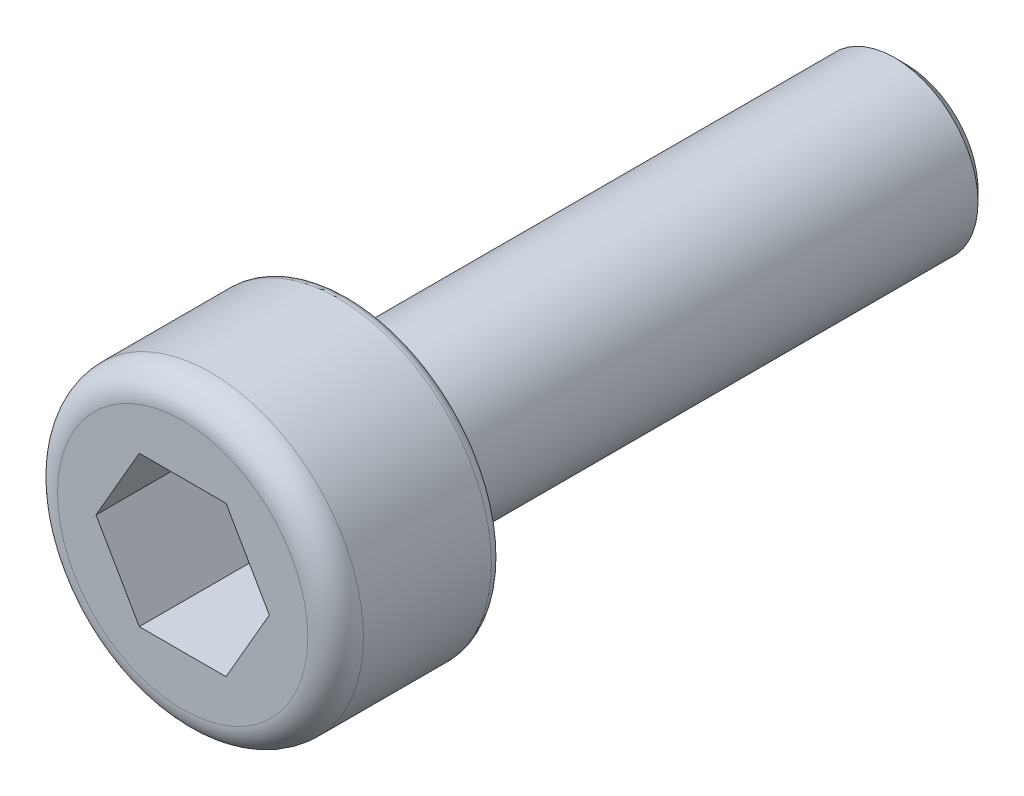
ISO-10303-21;
HEADER;
FILE_DESCRIPTION(('STEP AP214'),'2;1');
FILE_NAME('part.step','',(''),(''),'','','');
FILE_SCHEMA(('AUTOMOTIVE_DESIGN { 1 0 10303 214 1 1 1 1 }'));
ENDSEC;
DATA;
#1=APPLICATION_CONTEXT('core data for automotive mechanical design processes');
#2=APPLICATION_PROTOCOL_DEFINITION('international standard','automotive_design',2000,#1);
#3=PRODUCT_CONTEXT('',#1,'mechanical');
#4=PRODUCT('Part','Part','',(#3));
#5=PRODUCT_RELATED_PRODUCT_CATEGORY('part','',(#4));
#6=PRODUCT_DEFINITION_FORMATION('','',#4);
#7=PRODUCT_DEFINITION_CONTEXT('part definition',#1,'design');
#8=PRODUCT_DEFINITION('design','',#6,#7);
#9=PRODUCT_DEFINITION_SHAPE('','',#8);
#10=(LENGTH_UNIT() NAMED_UNIT(*) SI_UNIT(.MILLI.,.METRE.));
#11=(NAMED_UNIT(*) PLANE_ANGLE_UNIT() SI_UNIT($,.RADIAN.));
#12=(NAMED_UNIT(*) SI_UNIT($,.STERADIAN.) SOLID_ANGLE_UNIT());
#13=UNCERTAINTY_MEASURE_WITH_UNIT(LENGTH_MEASURE(1.E-05),#10,'distance_accuracy_value','');
#14=(GEOMETRIC_REPRESENTATION_CONTEXT(3) GLOBAL_UNCERTAINTY_ASSIGNED_CONTEXT((#13)) GLOBAL_UNIT_ASSIGNED_CONTEXT((#10,
#11,#12)) REPRESENTATION_CONTEXT('',''));
#15=CARTESIAN_POINT('',(0.,0.,0.));
#16=DIRECTION('',(0.,0.,1.));
#17=DIRECTION('',(1.,0.,0.));
#18=AXIS2_PLACEMENT_3D('',#15,#16,#17);
#19=CARTESIAN_POINT('',(0.,0.,0.));
#20=DIRECTION('',(0.,0.,1.));
#21=DIRECTION('',(1.,0.,0.));
#22=AXIS2_PLACEMENT_3D('',#19,#20,#21);
#23=PLANE('',#22);
#24=CARTESIAN_POINT('',(0.,0.,0.));
#25=DIRECTION('',(0.,0.,1.));
#26=DIRECTION('',(1.,0.,0.));
#27=AXIS2_PLACEMENT_3D('',#24,#25,#26);
#28=CIRCLE('',#27,2.55);
#29=CARTESIAN_POINT('',(2.55,0.,0.));
#30=VERTEX_POINT('',#29);
#31=EDGE_CURVE('E11',#30,#30,#28,.F.);
#32=ORIENTED_EDGE('',*,*,#31,.T.);
#33=EDGE_LOOP('',(#32));
#34=FACE_BOUND('',#33,.T.);
#35=CARTESIAN_POINT('',(0.,0.,0.));
#36=DIRECTION('',(0.,0.,1.));
#37=DIRECTION('',(1.,0.,0.));
#38=AXIS2_PLACEMENT_3D('',#35,#36,#37);
#39=CIRCLE('',#38,1.5);
#40=CARTESIAN_POINT('',(1.5,0.,0.));
#41=VERTEX_POINT('',#40);
#42=EDGE_CURVE('E147',#41,#41,#39,.F.);
#43=ORIENTED_EDGE('',*,*,#42,.F.);
#44=EDGE_LOOP('',(#43));
#45=FACE_BOUND('',#44,.T.);
#46=ADVANCED_FACE('F34',(#34,#45),#23,.F.);
#47=CARTESIAN_POINT('',(0.,0.,3.));
#48=DIRECTION('',(0.,0.,-1.));
#49=DIRECTION('',(-1.,0.,0.));
#50=AXIS2_PLACEMENT_3D('',#47,#48,#49);
#51=CYLINDRICAL_SURFACE('',#50,2.75);
#52=CARTESIAN_POINT('',(0.,0.,0.2));
#53=DIRECTION('',(0.,0.,1.));
#54=DIRECTION('',(1.,0.,0.));
#55=AXIS2_PLACEMENT_3D('',#52,#53,#54);
#56=CIRCLE('',#55,2.75);
#57=CARTESIAN_POINT('',(2.75,0.,0.2));
#58=VERTEX_POINT('',#57);
#59=EDGE_CURVE('E42',#58,#58,#56,.T.);
#60=ORIENTED_EDGE('',*,*,#59,.T.);
#61=EDGE_LOOP('',(#60));
#62=FACE_BOUND('',#61,.T.);
#63=CARTESIAN_POINT('',(0.,0.,2.5));
#64=DIRECTION('',(0.,0.,1.));
#65=DIRECTION('',(1.,0.,0.));
#66=AXIS2_PLACEMENT_3D('',#63,#64,#65);
#67=CIRCLE('',#66,2.75);
#68=CARTESIAN_POINT('',(2.75,0.,2.5));
#69=VERTEX_POINT('',#68);
#70=EDGE_CURVE('E144',#69,#69,#67,.F.);
#71=ORIENTED_EDGE('',*,*,#70,.T.);
#72=EDGE_LOOP('',(#71));
#73=FACE_BOUND('',#72,.T.);
#74=ADVANCED_FACE('F158',(#62,#73),#51,.T.);
#75=CARTESIAN_POINT('',(0.,0.,3.));
#76=DIRECTION('',(0.,0.,1.));
#77=DIRECTION('',(1.,0.,0.));
#78=AXIS2_PLACEMENT_3D('',#75,#76,#77);
#79=PLANE('',#78);
#80=DIRECTION('',(0.5,0.866025403784439,0.));
#81=VECTOR('',#80,1.);
#82=CARTESIAN_POINT('',(0.779422863405995,-1.35,3.));
#83=LINE('',#82,#81);
#84=CARTESIAN_POINT('',(0.779422863405995,-1.35,3.));
#85=VERTEX_POINT('',#84);
#86=CARTESIAN_POINT('',(1.55884572681199,0.,3.));
#87=VERTEX_POINT('',#86);
#88=EDGE_CURVE('E49',#85,#87,#83,.T.);
#89=ORIENTED_EDGE('',*,*,#88,.F.);
#90=DIRECTION('',(1.,0.,0.));
#91=VECTOR('',#90,1.);
#92=CARTESIAN_POINT('',(-0.779422863405994,-1.35,3.));
#93=LINE('',#92,#91);
#94=CARTESIAN_POINT('',(-0.779422863405994,-1.35,3.));
#95=VERTEX_POINT('',#94);
#96=EDGE_CURVE('E132',#95,#85,#93,.T.);
#97=ORIENTED_EDGE('',*,*,#96,.F.);
#98=DIRECTION('',(0.5,-0.866025403784438,0.));
#99=VECTOR('',#98,1.);
#100=CARTESIAN_POINT('',(-1.55884572681199,0.,3.));
#101=LINE('',#100,#99);
#102=CARTESIAN_POINT('',(-1.55884572681199,0.,3.));
#103=VERTEX_POINT('',#102);
#104=EDGE_CURVE('E130',#103,#95,#101,.T.);
#105=ORIENTED_EDGE('',*,*,#104,.F.);
#106=DIRECTION('',(-0.5,-0.866025403784438,0.));
#107=VECTOR('',#106,1.);
#108=CARTESIAN_POINT('',(-0.779422863405995,1.35,3.));
#109=LINE('',#108,#107);
#110=CARTESIAN_POINT('',(-0.779422863405995,1.35,3.));
#111=VERTEX_POINT('',#110);
#112=EDGE_CURVE('E97',#111,#103,#109,.T.);
#113=ORIENTED_EDGE('',*,*,#112,.F.);
#114=DIRECTION('',(-1.,0.,0.));
#115=VECTOR('',#114,1.);
#116=CARTESIAN_POINT('',(0.779422863405994,1.35,3.));
#117=LINE('',#116,#115);
#118=CARTESIAN_POINT('',(0.779422863405994,1.35,3.));
#119=VERTEX_POINT('',#118);
#120=EDGE_CURVE('E126',#119,#111,#117,.T.);
#121=ORIENTED_EDGE('',*,*,#120,.F.);
#122=DIRECTION('',(-0.5,0.866025403784438,0.));
#123=VECTOR('',#122,1.);
#124=CARTESIAN_POINT('',(1.55884572681199,0.,3.));
#125=LINE('',#124,#123);
#126=EDGE_CURVE('E123',#87,#119,#125,.T.);
#127=ORIENTED_EDGE('',*,*,#126,.F.);
#128=EDGE_LOOP('',(#89,#97,#105,#113,#121,#127));
#129=FACE_BOUND('',#128,.T.);
#130=CARTESIAN_POINT('',(0.,0.,3.));
#131=DIRECTION('',(0.,0.,1.));
#132=DIRECTION('',(1.,0.,0.));
#133=AXIS2_PLACEMENT_3D('',#130,#131,#132);
#134=CIRCLE('',#133,2.25);
#135=CARTESIAN_POINT('',(2.25,0.,3.));
#136=VERTEX_POINT('',#135);
#137=EDGE_CURVE('E136',#136,#136,#134,.T.);
#138=ORIENTED_EDGE('',*,*,#137,.T.);
#139=EDGE_LOOP('',(#138));
#140=FACE_BOUND('',#139,.T.);
#141=ADVANCED_FACE('F176',(#129,#140),#79,.T.);
#142=CARTESIAN_POINT('',(0.,0.,2.5));
#143=DIRECTION('',(0.,0.,1.));
#144=DIRECTION('',(1.,0.,0.));
#145=AXIS2_PLACEMENT_3D('',#142,#143,#144);
#146=TOROIDAL_SURFACE('',#145,2.25,0.5);
#147=ORIENTED_EDGE('',*,*,#70,.F.);
#148=EDGE_LOOP('',(#147));
#149=FACE_BOUND('',#148,.T.);
#150=ORIENTED_EDGE('',*,*,#137,.F.);
#151=EDGE_LOOP('',(#150));
#152=FACE_BOUND('',#151,.T.);
#153=ADVANCED_FACE('F182',(#149,#152),#146,.T.);
#154=CARTESIAN_POINT('',(0.779422863405995,-1.35,1.));
#155=DIRECTION('',(0.866025403784439,-0.5,0.));
#156=DIRECTION('',(0.5,0.866025403784439,0.));
#157=AXIS2_PLACEMENT_3D('',#154,#155,#156);
#158=PLANE('',#157);
#159=ORIENTED_EDGE('',*,*,#88,.T.);
#160=DIRECTION('',(0.,0.,1.));
#161=VECTOR('',#160,1.);
#162=CARTESIAN_POINT('',(1.55884572681199,0.,1.));
#163=LINE('',#162,#161);
#164=CARTESIAN_POINT('',(1.55884572681199,0.,1.));
#165=VERTEX_POINT('',#164);
#166=EDGE_CURVE('E79',#165,#87,#163,.T.);
#167=ORIENTED_EDGE('',*,*,#166,.F.);
#168=DIRECTION('',(0.5,0.866025403784439,0.));
#169=VECTOR('',#168,1.);
#170=CARTESIAN_POINT('',(0.779422863405995,-1.35,1.));
#171=LINE('',#170,#169);
#172=CARTESIAN_POINT('',(0.779422863405995,-1.35,1.));
#173=VERTEX_POINT('',#172);
#174=EDGE_CURVE('E134',#173,#165,#171,.T.);
#175=ORIENTED_EDGE('',*,*,#174,.F.);
#176=DIRECTION('',(0.,0.,1.));
#177=VECTOR('',#176,1.);
#178=CARTESIAN_POINT('',(0.779422863405995,-1.35,1.));
#179=LINE('',#178,#177);
#180=EDGE_CURVE('E57',#173,#85,#179,.T.);
#181=ORIENTED_EDGE('',*,*,#180,.T.);
#182=EDGE_LOOP('',(#159,#167,#175,#181));
#183=FACE_BOUND('',#182,.T.);
#184=ADVANCED_FACE('F184',(#183),#158,.F.);
#185=CARTESIAN_POINT('',(-0.779422863405994,-1.35,1.));
#186=DIRECTION('',(0.,-1.,0.));
#187=DIRECTION('',(0.,0.,-1.));
#188=AXIS2_PLACEMENT_3D('',#185,#186,#187);
#189=PLANE('',#188);
#190=ORIENTED_EDGE('',*,*,#96,.T.);
#191=ORIENTED_EDGE('',*,*,#180,.F.);
#192=DIRECTION('',(1.,0.,0.));
#193=VECTOR('',#192,1.);
#194=CARTESIAN_POINT('',(-0.779422863405994,-1.35,1.));
#195=LINE('',#194,#193);
#196=CARTESIAN_POINT('',(-0.779422863405994,-1.35,1.));
#197=VERTEX_POINT('',#196);
#198=EDGE_CURVE('E109',#197,#173,#195,.T.);
#199=ORIENTED_EDGE('',*,*,#198,.F.);
#200=DIRECTION('',(0.,0.,1.));
#201=VECTOR('',#200,1.);
#202=CARTESIAN_POINT('',(-0.779422863405994,-1.35,1.));
#203=LINE('',#202,#201);
#204=EDGE_CURVE('E101',#197,#95,#203,.T.);
#205=ORIENTED_EDGE('',*,*,#204,.T.);
#206=EDGE_LOOP('',(#190,#191,#199,#205));
#207=FACE_BOUND('',#206,.T.);
#208=ADVANCED_FACE('F190',(#207),#189,.F.);
#209=CARTESIAN_POINT('',(-1.55884572681199,0.,1.));
#210=DIRECTION('',(-0.866025403784438,-0.5,0.));
#211=DIRECTION('',(0.5,-0.866025403784438,0.));
#212=AXIS2_PLACEMENT_3D('',#209,#210,#211);
#213=PLANE('',#212);
#214=ORIENTED_EDGE('',*,*,#104,.T.);
#215=ORIENTED_EDGE('',*,*,#204,.F.);
#216=DIRECTION('',(0.5,-0.866025403784438,0.));
#217=VECTOR('',#216,1.);
#218=CARTESIAN_POINT('',(-1.55884572681199,0.,1.));
#219=LINE('',#218,#217);
#220=CARTESIAN_POINT('',(-1.55884572681199,0.,1.));
#221=VERTEX_POINT('',#220);
#222=EDGE_CURVE('E105',#221,#197,#219,.T.);
#223=ORIENTED_EDGE('',*,*,#222,.F.);
#224=DIRECTION('',(0.,0.,1.));
#225=VECTOR('',#224,1.);
#226=CARTESIAN_POINT('',(-1.55884572681199,0.,1.));
#227=LINE('',#226,#225);
#228=EDGE_CURVE('E90',#221,#103,#227,.T.);
#229=ORIENTED_EDGE('',*,*,#228,.T.);
#230=EDGE_LOOP('',(#214,#215,#223,#229));
#231=FACE_BOUND('',#230,.T.);
#232=ADVANCED_FACE('F106',(#231),#213,.F.);
#233=CARTESIAN_POINT('',(-0.779422863405995,1.35,1.));
#234=DIRECTION('',(-0.866025403784439,0.5,0.));
#235=DIRECTION('',(-0.5,-0.866025403784439,0.));
#236=AXIS2_PLACEMENT_3D('',#233,#234,#235);
#237=PLANE('',#236);
#238=ORIENTED_EDGE('',*,*,#112,.T.);
#239=ORIENTED_EDGE('',*,*,#228,.F.);
#240=DIRECTION('',(-0.5,-0.866025403784438,0.));
#241=VECTOR('',#240,1.);
#242=CARTESIAN_POINT('',(-0.779422863405995,1.35,1.));
#243=LINE('',#242,#241);
#244=CARTESIAN_POINT('',(-0.779422863405995,1.35,1.));
#245=VERTEX_POINT('',#244);
#246=EDGE_CURVE('E94',#245,#221,#243,.T.);
#247=ORIENTED_EDGE('',*,*,#246,.F.);
#248=DIRECTION('',(0.,0.,1.));
#249=VECTOR('',#248,1.);
#250=CARTESIAN_POINT('',(-0.779422863405995,1.35,1.));
#251=LINE('',#250,#249);
#252=EDGE_CURVE('E102',#245,#111,#251,.T.);
#253=ORIENTED_EDGE('',*,*,#252,.T.);
#254=EDGE_LOOP('',(#238,#239,#247,#253));
#255=FACE_BOUND('',#254,.T.);
#256=ADVANCED_FACE('F92',(#255),#237,.F.);
#257=CARTESIAN_POINT('',(0.779422863405994,1.35,1.));
#258=DIRECTION('',(0.,1.,0.));
#259=DIRECTION('',(0.,0.,1.));
#260=AXIS2_PLACEMENT_3D('',#257,#258,#259);
#261=PLANE('',#260);
#262=ORIENTED_EDGE('',*,*,#120,.T.);
#263=ORIENTED_EDGE('',*,*,#252,.F.);
#264=DIRECTION('',(-1.,0.,0.));
#265=VECTOR('',#264,1.);
#266=CARTESIAN_POINT('',(0.779422863405994,1.35,1.));
#267=LINE('',#266,#265);
#268=CARTESIAN_POINT('',(0.779422863405994,1.35,1.));
#269=VERTEX_POINT('',#268);
#270=EDGE_CURVE('E115',#269,#245,#267,.T.);
#271=ORIENTED_EDGE('',*,*,#270,.F.);
#272=DIRECTION('',(0.,0.,1.));
#273=VECTOR('',#272,1.);
#274=CARTESIAN_POINT('',(0.779422863405994,1.35,1.));
#275=LINE('',#274,#273);
#276=EDGE_CURVE('E139',#269,#119,#275,.T.);
#277=ORIENTED_EDGE('',*,*,#276,.T.);
#278=EDGE_LOOP('',(#262,#263,#271,#277));
#279=FACE_BOUND('',#278,.T.);
#280=ADVANCED_FACE('F215',(#279),#261,.F.);
#281=CARTESIAN_POINT('',(1.55884572681199,0.,1.));
#282=DIRECTION('',(0.866025403784438,0.5,0.));
#283=DIRECTION('',(-0.5,0.866025403784438,0.));
#284=AXIS2_PLACEMENT_3D('',#281,#282,#283);
#285=PLANE('',#284);
#286=ORIENTED_EDGE('',*,*,#126,.T.);
#287=ORIENTED_EDGE('',*,*,#276,.F.);
#288=DIRECTION('',(-0.5,0.866025403784438,0.));
#289=VECTOR('',#288,1.);
#290=CARTESIAN_POINT('',(1.55884572681199,0.,1.));
#291=LINE('',#290,#289);
#292=EDGE_CURVE('E117',#165,#269,#291,.T.);
#293=ORIENTED_EDGE('',*,*,#292,.F.);
#294=ORIENTED_EDGE('',*,*,#166,.T.);
#295=EDGE_LOOP('',(#286,#287,#293,#294));
#296=FACE_BOUND('',#295,.T.);
#297=ADVANCED_FACE('F202',(#296),#285,.F.);
#298=CARTESIAN_POINT('',(0.,0.,1.));
#299=DIRECTION('',(0.,0.,1.));
#300=DIRECTION('',(1.,0.,0.));
#301=AXIS2_PLACEMENT_3D('',#298,#299,#300);
#302=PLANE('',#301);
#303=ORIENTED_EDGE('',*,*,#174,.T.);
#304=ORIENTED_EDGE('',*,*,#292,.T.);
#305=ORIENTED_EDGE('',*,*,#270,.T.);
#306=ORIENTED_EDGE('',*,*,#246,.T.);
#307=ORIENTED_EDGE('',*,*,#222,.T.);
#308=ORIENTED_EDGE('',*,*,#198,.T.);
#309=EDGE_LOOP('',(#303,#304,#305,#306,#307,#308));
#310=FACE_BOUND('',#309,.T.);
#311=ADVANCED_FACE('F112',(#310),#302,.T.);
#312=CARTESIAN_POINT('',(0.,0.,-10.));
#313=DIRECTION('',(0.,0.,1.));
#314=DIRECTION('',(1.,0.,0.));
#315=AXIS2_PLACEMENT_3D('',#312,#313,#314);
#316=CYLINDRICAL_SURFACE('',#315,1.5);
#317=CARTESIAN_POINT('',(0.,0.,-9.8));
#318=DIRECTION('',(0.,0.,-1.));
#319=DIRECTION('',(-1.,0.,0.));
#320=AXIS2_PLACEMENT_3D('',#317,#318,#319);
#321=CIRCLE('',#320,1.5);
#322=CARTESIAN_POINT('',(-1.5,0.,-9.8));
#323=VERTEX_POINT('',#322);
#324=EDGE_CURVE('E153',#323,#323,#321,.F.);
#325=ORIENTED_EDGE('',*,*,#324,.T.);
#326=EDGE_LOOP('',(#325));
#327=FACE_BOUND('',#326,.T.);
#328=ORIENTED_EDGE('',*,*,#42,.T.);
#329=EDGE_LOOP('',(#328));
#330=FACE_BOUND('',#329,.T.);
#331=ADVANCED_FACE('F223',(#327,#330),#316,.T.);
#332=CARTESIAN_POINT('',(0.,0.,-10.));
#333=DIRECTION('',(0.,0.,-1.));
#334=DIRECTION('',(-1.,0.,0.));
#335=AXIS2_PLACEMENT_3D('',#332,#333,#334);
#336=PLANE('',#335);
#337=CARTESIAN_POINT('',(0.,0.,-10.));
#338=DIRECTION('',(0.,0.,-1.));
#339=DIRECTION('',(-1.,0.,0.));
#340=AXIS2_PLACEMENT_3D('',#337,#338,#339);
#341=CIRCLE('',#340,1.3);
#342=CARTESIAN_POINT('',(-1.3,0.,-10.));
#343=VERTEX_POINT('',#342);
#344=EDGE_CURVE('E150',#343,#343,#341,.T.);
#345=ORIENTED_EDGE('',*,*,#344,.T.);
#346=EDGE_LOOP('',(#345));
#347=FACE_BOUND('',#346,.T.);
#348=ADVANCED_FACE('F167',(#347),#336,.T.);
#349=CARTESIAN_POINT('',(0.,0.,-10.));
#350=DIRECTION('',(0.,0.,1.));
#351=DIRECTION('',(1.,0.,0.));
#352=AXIS2_PLACEMENT_3D('',#349,#350,#351);
#353=CONICAL_SURFACE('',#352,1.3,0.785398163397446);
#354=ORIENTED_EDGE('',*,*,#324,.F.);
#355=EDGE_LOOP('',(#354));
#356=FACE_BOUND('',#355,.T.);
#357=ORIENTED_EDGE('',*,*,#344,.F.);
#358=EDGE_LOOP('',(#357));
#359=FACE_BOUND('',#358,.T.);
#360=ADVANCED_FACE('F162',(#356,#359),#353,.T.);
#361=CARTESIAN_POINT('',(0.,0.,0.2));
#362=DIRECTION('',(0.,0.,1.));
#363=DIRECTION('',(1.,0.,0.));
#364=AXIS2_PLACEMENT_3D('',#361,#362,#363);
#365=TOROIDAL_SURFACE('',#364,2.55,0.2);
#366=ORIENTED_EDGE('',*,*,#31,.F.);
#367=EDGE_LOOP('',(#366));
#368=FACE_BOUND('',#367,.T.);
#369=ORIENTED_EDGE('',*,*,#59,.F.);
#370=EDGE_LOOP('',(#369));
#371=FACE_BOUND('',#370,.T.);
#372=ADVANCED_FACE('F36',(#368,#371),#365,.T.);
#373=CLOSED_SHELL('',(#46,#74,#141,#153,#184,#208,#232,#256,#280,#297,#311,#331,#348,#360,#372));
#374=MANIFOLD_SOLID_BREP('B2',#373);
#375=ADVANCED_BREP_SHAPE_REPRESENTATION('',(#18,#374),#14);
#376=SHAPE_DEFINITION_REPRESENTATION(#9,#375);
ENDSEC;
END-ISO-10303-21;
